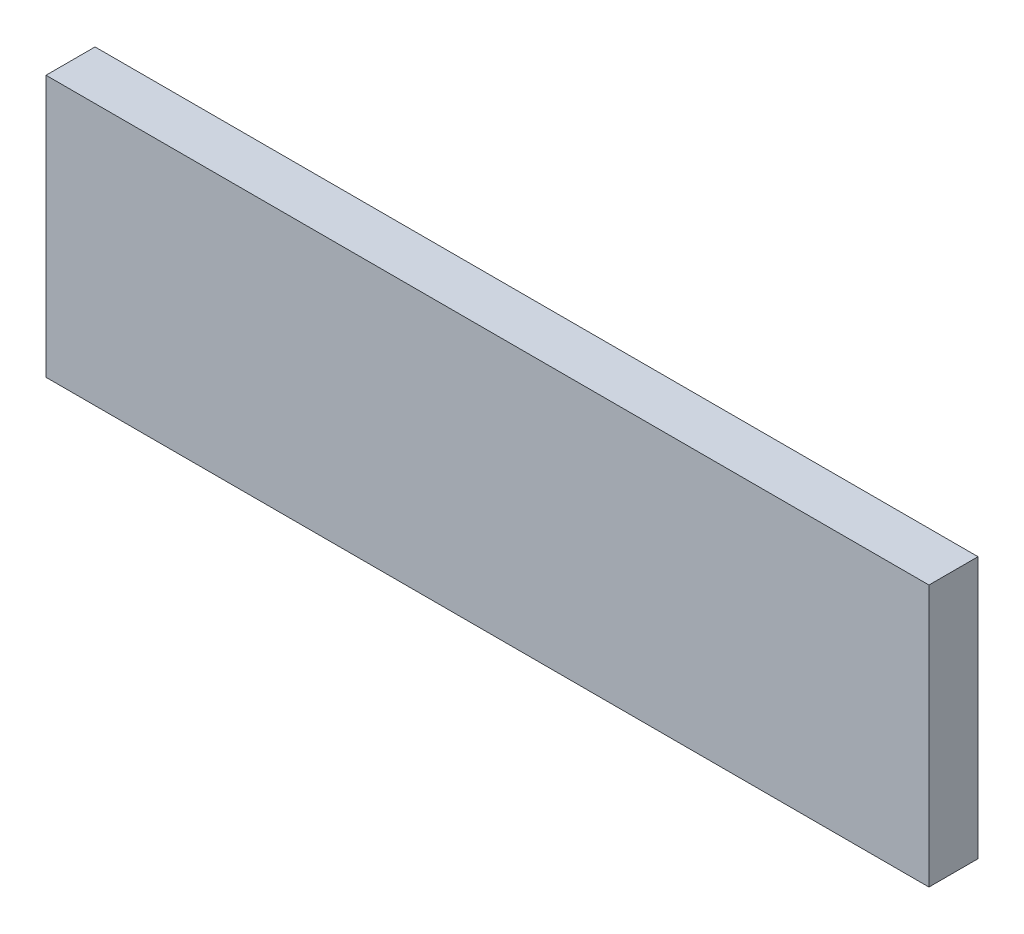
ISO-10303-21;
HEADER;
FILE_DESCRIPTION(('STEP AP214'),'2;1');
FILE_NAME('part.step','',(''),(''),'','','');
FILE_SCHEMA(('AUTOMOTIVE_DESIGN { 1 0 10303 214 1 1 1 1 }'));
ENDSEC;
DATA;
#1=APPLICATION_CONTEXT('core data for automotive mechanical design processes');
#2=APPLICATION_PROTOCOL_DEFINITION('international standard','automotive_design',2000,#1);
#3=PRODUCT_CONTEXT('',#1,'mechanical');
#4=PRODUCT('Part','Part','',(#3));
#5=PRODUCT_RELATED_PRODUCT_CATEGORY('part','',(#4));
#6=PRODUCT_DEFINITION_FORMATION('','',#4);
#7=PRODUCT_DEFINITION_CONTEXT('part definition',#1,'design');
#8=PRODUCT_DEFINITION('design','',#6,#7);
#9=PRODUCT_DEFINITION_SHAPE('','',#8);
#10=(LENGTH_UNIT() NAMED_UNIT(*) SI_UNIT(.MILLI.,.METRE.));
#11=(NAMED_UNIT(*) PLANE_ANGLE_UNIT() SI_UNIT($,.RADIAN.));
#12=(NAMED_UNIT(*) SI_UNIT($,.STERADIAN.) SOLID_ANGLE_UNIT());
#13=UNCERTAINTY_MEASURE_WITH_UNIT(LENGTH_MEASURE(1.E-05),#10,'distance_accuracy_value','');
#14=(GEOMETRIC_REPRESENTATION_CONTEXT(3) GLOBAL_UNCERTAINTY_ASSIGNED_CONTEXT((#13)) GLOBAL_UNIT_ASSIGNED_CONTEXT((#10,
#11,#12)) REPRESENTATION_CONTEXT('',''));
#15=CARTESIAN_POINT('',(0.,0.,0.));
#16=DIRECTION('',(0.,0.,1.));
#17=DIRECTION('',(1.,0.,0.));
#18=AXIS2_PLACEMENT_3D('',#15,#16,#17);
#19=CARTESIAN_POINT('',(-1.34999984,0.40000174,0.15));
#20=DIRECTION('',(0.,0.,1.));
#21=DIRECTION('',(1.,0.,0.));
#22=AXIS2_PLACEMENT_3D('',#19,#20,#21);
#23=PLANE('',#22);
#24=DIRECTION('',(0.,1.,0.));
#25=VECTOR('',#24,1.);
#26=CARTESIAN_POINT('',(1.34999984,0.40000174,0.15));
#27=LINE('',#26,#25);
#28=CARTESIAN_POINT('',(1.34999984,0.40000174,0.15));
#29=VERTEX_POINT('',#28);
#30=CARTESIAN_POINT('',(1.34999984,-0.3999992,0.15));
#31=VERTEX_POINT('',#30);
#32=EDGE_CURVE('E52',#29,#31,#27,.F.);
#33=ORIENTED_EDGE('',*,*,#32,.F.);
#34=DIRECTION('',(1.,0.,0.));
#35=VECTOR('',#34,1.);
#36=CARTESIAN_POINT('',(-1.34999984,0.40000174,0.15));
#37=LINE('',#36,#35);
#38=CARTESIAN_POINT('',(-1.34999984,0.40000174,0.15));
#39=VERTEX_POINT('',#38);
#40=EDGE_CURVE('E67',#39,#29,#37,.T.);
#41=ORIENTED_EDGE('',*,*,#40,.F.);
#42=DIRECTION('',(0.,1.,0.));
#43=VECTOR('',#42,1.);
#44=CARTESIAN_POINT('',(-1.34999984,-0.3999992,0.15));
#45=LINE('',#44,#43);
#46=CARTESIAN_POINT('',(-1.34999984,-0.3999992,0.15));
#47=VERTEX_POINT('',#46);
#48=EDGE_CURVE('E19',#47,#39,#45,.T.);
#49=ORIENTED_EDGE('',*,*,#48,.F.);
#50=DIRECTION('',(1.,0.,0.));
#51=VECTOR('',#50,1.);
#52=CARTESIAN_POINT('',(1.34999984,-0.3999992,0.15));
#53=LINE('',#52,#51);
#54=EDGE_CURVE('E57',#31,#47,#53,.F.);
#55=ORIENTED_EDGE('',*,*,#54,.F.);
#56=EDGE_LOOP('',(#33,#41,#49,#55));
#57=FACE_BOUND('',#56,.T.);
#58=ADVANCED_FACE('F16',(#57),#23,.T.);
#59=CARTESIAN_POINT('',(-1.34999984,-0.3999992,0.));
#60=DIRECTION('',(-1.,0.,0.));
#61=DIRECTION('',(0.,0.,1.));
#62=AXIS2_PLACEMENT_3D('',#59,#60,#61);
#63=PLANE('',#62);
#64=DIRECTION('',(0.,0.,1.));
#65=VECTOR('',#64,1.);
#66=CARTESIAN_POINT('',(-1.34999984,0.40000174,0.));
#67=LINE('',#66,#65);
#68=CARTESIAN_POINT('',(-1.34999984,0.40000174,0.));
#69=VERTEX_POINT('',#68);
#70=EDGE_CURVE('E78',#69,#39,#67,.T.);
#71=ORIENTED_EDGE('',*,*,#70,.F.);
#72=DIRECTION('',(0.,1.,0.));
#73=VECTOR('',#72,1.);
#74=CARTESIAN_POINT('',(-1.34999984,0.40000174,0.));
#75=LINE('',#74,#73);
#76=CARTESIAN_POINT('',(-1.34999984,-0.3999992,0.));
#77=VERTEX_POINT('',#76);
#78=EDGE_CURVE('E73',#69,#77,#75,.F.);
#79=ORIENTED_EDGE('',*,*,#78,.T.);
#80=DIRECTION('',(0.,0.,-1.));
#81=VECTOR('',#80,1.);
#82=CARTESIAN_POINT('',(-1.34999984,-0.3999992,0.));
#83=LINE('',#82,#81);
#84=EDGE_CURVE('E62',#47,#77,#83,.T.);
#85=ORIENTED_EDGE('',*,*,#84,.F.);
#86=ORIENTED_EDGE('',*,*,#48,.T.);
#87=EDGE_LOOP('',(#71,#79,#85,#86));
#88=FACE_BOUND('',#87,.T.);
#89=ADVANCED_FACE('F72',(#88),#63,.T.);
#90=CARTESIAN_POINT('',(1.34999984,-0.3999992,0.));
#91=DIRECTION('',(0.,-1.,0.));
#92=DIRECTION('',(0.,0.,-1.));
#93=AXIS2_PLACEMENT_3D('',#90,#91,#92);
#94=PLANE('',#93);
#95=ORIENTED_EDGE('',*,*,#84,.T.);
#96=DIRECTION('',(1.,0.,0.));
#97=VECTOR('',#96,1.);
#98=CARTESIAN_POINT('',(-1.34999984,-0.3999992,0.));
#99=LINE('',#98,#97);
#100=CARTESIAN_POINT('',(1.34999984,-0.3999992,0.));
#101=VERTEX_POINT('',#100);
#102=EDGE_CURVE('E83',#77,#101,#99,.T.);
#103=ORIENTED_EDGE('',*,*,#102,.T.);
#104=DIRECTION('',(0.,0.,-1.));
#105=VECTOR('',#104,1.);
#106=CARTESIAN_POINT('',(1.34999984,-0.3999992,0.));
#107=LINE('',#106,#105);
#108=EDGE_CURVE('E64',#31,#101,#107,.T.);
#109=ORIENTED_EDGE('',*,*,#108,.F.);
#110=ORIENTED_EDGE('',*,*,#54,.T.);
#111=EDGE_LOOP('',(#95,#103,#109,#110));
#112=FACE_BOUND('',#111,.T.);
#113=ADVANCED_FACE('F59',(#112),#94,.T.);
#114=CARTESIAN_POINT('',(1.34999984,0.40000174,0.));
#115=DIRECTION('',(1.,0.,0.));
#116=DIRECTION('',(0.,0.,-1.));
#117=AXIS2_PLACEMENT_3D('',#114,#115,#116);
#118=PLANE('',#117);
#119=ORIENTED_EDGE('',*,*,#108,.T.);
#120=DIRECTION('',(0.,1.,0.));
#121=VECTOR('',#120,1.);
#122=CARTESIAN_POINT('',(1.34999984,0.40000174,0.));
#123=LINE('',#122,#121);
#124=CARTESIAN_POINT('',(1.34999984,0.40000174,0.));
#125=VERTEX_POINT('',#124);
#126=EDGE_CURVE('E25',#101,#125,#123,.T.);
#127=ORIENTED_EDGE('',*,*,#126,.T.);
#128=DIRECTION('',(0.,0.,1.));
#129=VECTOR('',#128,1.);
#130=CARTESIAN_POINT('',(1.34999984,0.40000174,0.));
#131=LINE('',#130,#129);
#132=EDGE_CURVE('E33',#29,#125,#131,.F.);
#133=ORIENTED_EDGE('',*,*,#132,.F.);
#134=ORIENTED_EDGE('',*,*,#32,.T.);
#135=EDGE_LOOP('',(#119,#127,#133,#134));
#136=FACE_BOUND('',#135,.T.);
#137=ADVANCED_FACE('F87',(#136),#118,.T.);
#138=CARTESIAN_POINT('',(-1.34999984,0.40000174,0.));
#139=DIRECTION('',(0.,1.,0.));
#140=DIRECTION('',(0.,0.,1.));
#141=AXIS2_PLACEMENT_3D('',#138,#139,#140);
#142=PLANE('',#141);
#143=ORIENTED_EDGE('',*,*,#132,.T.);
#144=DIRECTION('',(1.,0.,0.));
#145=VECTOR('',#144,1.);
#146=CARTESIAN_POINT('',(-1.34999984,0.40000174,0.));
#147=LINE('',#146,#145);
#148=EDGE_CURVE('E11',#125,#69,#147,.F.);
#149=ORIENTED_EDGE('',*,*,#148,.T.);
#150=ORIENTED_EDGE('',*,*,#70,.T.);
#151=ORIENTED_EDGE('',*,*,#40,.T.);
#152=EDGE_LOOP('',(#143,#149,#150,#151));
#153=FACE_BOUND('',#152,.T.);
#154=ADVANCED_FACE('F90',(#153),#142,.T.);
#155=CARTESIAN_POINT('',(-1.34999984,0.40000174,0.));
#156=DIRECTION('',(0.,0.,1.));
#157=DIRECTION('',(1.,0.,0.));
#158=AXIS2_PLACEMENT_3D('',#155,#156,#157);
#159=PLANE('',#158);
#160=ORIENTED_EDGE('',*,*,#126,.F.);
#161=ORIENTED_EDGE('',*,*,#102,.F.);
#162=ORIENTED_EDGE('',*,*,#78,.F.);
#163=ORIENTED_EDGE('',*,*,#148,.F.);
#164=EDGE_LOOP('',(#160,#161,#162,#163));
#165=FACE_BOUND('',#164,.T.);
#166=ADVANCED_FACE('F89',(#165),#159,.F.);
#167=CLOSED_SHELL('',(#58,#89,#113,#137,#154,#166));
#168=MANIFOLD_SOLID_BREP('B1',#167);
#169=ADVANCED_BREP_SHAPE_REPRESENTATION('',(#18,#168),#14);
#170=SHAPE_DEFINITION_REPRESENTATION(#9,#169);
ENDSEC;
END-ISO-10303-21;
